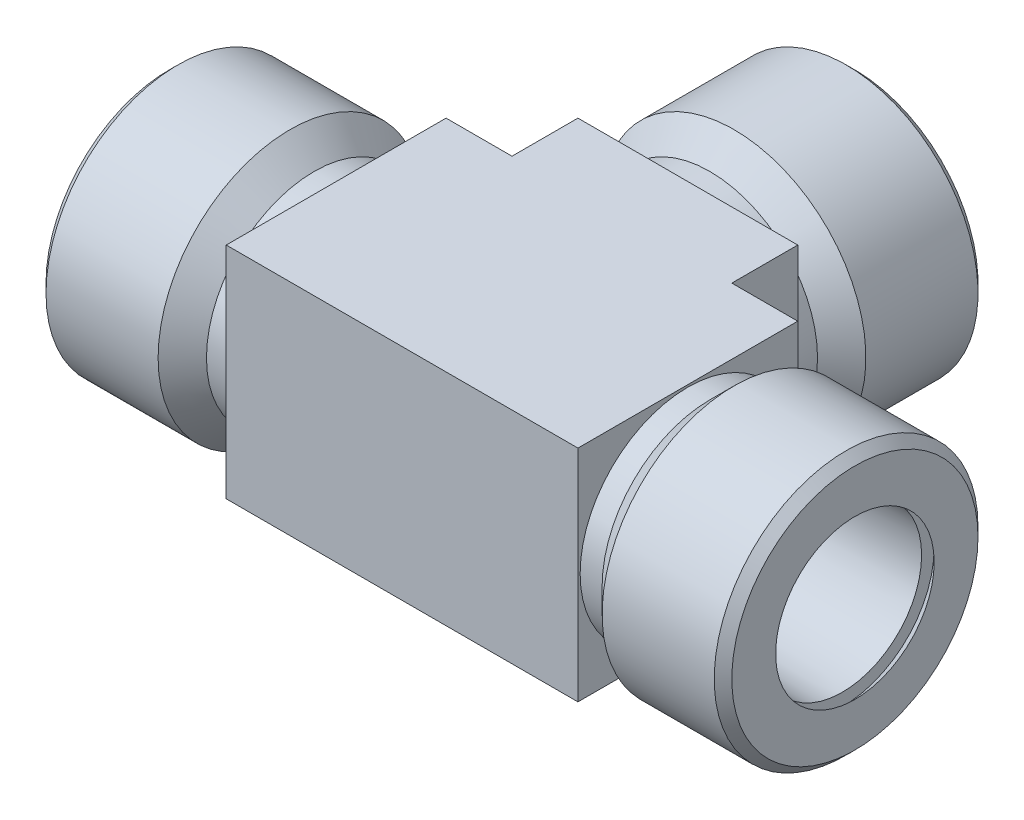
ISO-10303-21;
HEADER;
FILE_DESCRIPTION(('STEP AP214'),'2;1');
FILE_NAME('part.step','',(''),(''),'','','');
FILE_SCHEMA(('AUTOMOTIVE_DESIGN { 1 0 10303 214 1 1 1 1 }'));
ENDSEC;
DATA;
#1=APPLICATION_CONTEXT('core data for automotive mechanical design processes');
#2=APPLICATION_PROTOCOL_DEFINITION('international standard','automotive_design',2000,#1);
#3=PRODUCT_CONTEXT('',#1,'mechanical');
#4=PRODUCT('Part','Part','',(#3));
#5=PRODUCT_RELATED_PRODUCT_CATEGORY('part','',(#4));
#6=PRODUCT_DEFINITION_FORMATION('','',#4);
#7=PRODUCT_DEFINITION_CONTEXT('part definition',#1,'design');
#8=PRODUCT_DEFINITION('design','',#6,#7);
#9=PRODUCT_DEFINITION_SHAPE('','',#8);
#10=(LENGTH_UNIT() NAMED_UNIT(*) SI_UNIT(.MILLI.,.METRE.));
#11=(NAMED_UNIT(*) PLANE_ANGLE_UNIT() SI_UNIT($,.RADIAN.));
#12=(NAMED_UNIT(*) SI_UNIT($,.STERADIAN.) SOLID_ANGLE_UNIT());
#13=UNCERTAINTY_MEASURE_WITH_UNIT(LENGTH_MEASURE(1.E-05),#10,'distance_accuracy_value','');
#14=(GEOMETRIC_REPRESENTATION_CONTEXT(3) GLOBAL_UNCERTAINTY_ASSIGNED_CONTEXT((#13)) GLOBAL_UNIT_ASSIGNED_CONTEXT((#10,
#11,#12)) REPRESENTATION_CONTEXT('',''));
#15=CARTESIAN_POINT('',(0.,0.,0.));
#16=DIRECTION('',(0.,0.,1.));
#17=DIRECTION('',(1.,0.,0.));
#18=AXIS2_PLACEMENT_3D('',#15,#16,#17);
#19=CARTESIAN_POINT('',(65.67678,0.,0.));
#20=DIRECTION('',(-1.,0.,0.));
#21=DIRECTION('',(0.,0.,1.));
#22=AXIS2_PLACEMENT_3D('',#19,#20,#21);
#23=CYLINDRICAL_SURFACE('',#22,9.271);
#24=CARTESIAN_POINT('',(39.624,0.,0.));
#25=DIRECTION('',(0.707106781186548,0.,-0.707106781186547));
#26=DIRECTION('',(-0.707106781186547,0.,-0.707106781186548));
#27=AXIS2_PLACEMENT_3D('',#24,#25,#26);
#28=ELLIPSE('',#27,13.111173936761,9.271);
#29=CARTESIAN_POINT('',(39.624,9.271,0.));
#30=VERTEX_POINT('',#29);
#31=CARTESIAN_POINT('',(39.624,-9.271,0.));
#32=VERTEX_POINT('',#31);
#33=EDGE_CURVE('E85',#30,#32,#28,.F.);
#34=ORIENTED_EDGE('',*,*,#33,.F.);
#35=CARTESIAN_POINT('',(39.624,0.,0.));
#36=DIRECTION('',(-0.707106781186547,0.,-0.707106781186548));
#37=DIRECTION('',(0.707106781186548,0.,-0.707106781186547));
#38=AXIS2_PLACEMENT_3D('',#35,#36,#37);
#39=ELLIPSE('',#38,13.111173936761,9.271);
#40=EDGE_CURVE('E31',#32,#30,#39,.F.);
#41=ORIENTED_EDGE('',*,*,#40,.F.);
#42=EDGE_LOOP('',(#34,#41));
#43=FACE_BOUND('',#42,.T.);
#44=CARTESIAN_POINT('',(65.67678,0.,0.));
#45=DIRECTION('',(-1.,0.,0.));
#46=DIRECTION('',(0.,0.,-1.));
#47=AXIS2_PLACEMENT_3D('',#44,#45,#46);
#48=CIRCLE('',#47,9.271);
#49=CARTESIAN_POINT('',(65.67678,0.,-9.271));
#50=VERTEX_POINT('',#49);
#51=EDGE_CURVE('E94',#50,#50,#48,.T.);
#52=ORIENTED_EDGE('',*,*,#51,.F.);
#53=EDGE_LOOP('',(#52));
#54=FACE_BOUND('',#53,.T.);
#55=CARTESIAN_POINT('',(13.57122,0.,0.));
#56=DIRECTION('',(-1.,0.,0.));
#57=DIRECTION('',(0.,0.,-1.));
#58=AXIS2_PLACEMENT_3D('',#55,#56,#57);
#59=CIRCLE('',#58,9.271);
#60=CARTESIAN_POINT('',(13.57122,0.,-9.271));
#61=VERTEX_POINT('',#60);
#62=EDGE_CURVE('E91',#61,#61,#59,.T.);
#63=ORIENTED_EDGE('',*,*,#62,.T.);
#64=EDGE_LOOP('',(#63));
#65=FACE_BOUND('',#64,.T.);
#66=ADVANCED_FACE('F17',(#43,#54,#65),#23,.F.);
#67=CARTESIAN_POINT('',(65.67678,0.,0.));
#68=DIRECTION('',(1.,0.,0.));
#69=DIRECTION('',(0.,0.,-1.));
#70=AXIS2_PLACEMENT_3D('',#67,#68,#69);
#71=PLANE('',#70);
#72=CARTESIAN_POINT('',(65.67678,0.,0.));
#73=DIRECTION('',(-1.,0.,0.));
#74=DIRECTION('',(0.,0.,-1.));
#75=AXIS2_PLACEMENT_3D('',#72,#73,#74);
#76=CIRCLE('',#75,8.84936340276163);
#77=CARTESIAN_POINT('',(65.67678,0.,-8.84936340276163));
#78=VERTEX_POINT('',#77);
#79=EDGE_CURVE('E400',#78,#78,#76,.T.);
#80=ORIENTED_EDGE('',*,*,#79,.F.);
#81=EDGE_LOOP('',(#80));
#82=FACE_BOUND('',#81,.T.);
#83=ORIENTED_EDGE('',*,*,#51,.T.);
#84=EDGE_LOOP('',(#83));
#85=FACE_BOUND('',#84,.T.);
#86=ADVANCED_FACE('F217',(#82,#85),#71,.F.);
#87=CARTESIAN_POINT('',(13.57122,0.,0.));
#88=DIRECTION('',(1.,0.,0.));
#89=DIRECTION('',(0.,0.,-1.));
#90=AXIS2_PLACEMENT_3D('',#87,#88,#89);
#91=PLANE('',#90);
#92=CARTESIAN_POINT('',(13.57122,0.,0.));
#93=DIRECTION('',(1.,0.,0.));
#94=DIRECTION('',(0.,0.,1.));
#95=AXIS2_PLACEMENT_3D('',#92,#93,#94);
#96=CIRCLE('',#95,8.84936340276163);
#97=CARTESIAN_POINT('',(13.57122,0.,8.84936340276163));
#98=VERTEX_POINT('',#97);
#99=EDGE_CURVE('E340',#98,#98,#96,.T.);
#100=ORIENTED_EDGE('',*,*,#99,.F.);
#101=EDGE_LOOP('',(#100));
#102=FACE_BOUND('',#101,.T.);
#103=ORIENTED_EDGE('',*,*,#62,.F.);
#104=EDGE_LOOP('',(#103));
#105=FACE_BOUND('',#104,.T.);
#106=ADVANCED_FACE('F223',(#102,#105),#91,.T.);
#107=CARTESIAN_POINT('',(39.624,0.,-26.05278));
#108=DIRECTION('',(0.,0.,1.));
#109=DIRECTION('',(1.,0.,0.));
#110=AXIS2_PLACEMENT_3D('',#107,#108,#109);
#111=PLANE('',#110);
#112=CARTESIAN_POINT('',(39.624,0.,-26.05278));
#113=DIRECTION('',(0.,0.,1.));
#114=DIRECTION('',(-1.,0.,0.));
#115=AXIS2_PLACEMENT_3D('',#112,#113,#114);
#116=CIRCLE('',#115,8.84936340276166);
#117=CARTESIAN_POINT('',(30.7746365972383,0.,-26.05278));
#118=VERTEX_POINT('',#117);
#119=EDGE_CURVE('E333',#118,#118,#116,.T.);
#120=ORIENTED_EDGE('',*,*,#119,.F.);
#121=EDGE_LOOP('',(#120));
#122=FACE_BOUND('',#121,.T.);
#123=CARTESIAN_POINT('',(39.624,0.,-26.05278));
#124=DIRECTION('',(0.,0.,-1.));
#125=DIRECTION('',(1.,0.,0.));
#126=AXIS2_PLACEMENT_3D('',#123,#124,#125);
#127=CIRCLE('',#126,9.271);
#128=CARTESIAN_POINT('',(48.895,0.,-26.05278));
#129=VERTEX_POINT('',#128);
#130=EDGE_CURVE('E88',#129,#129,#127,.T.);
#131=ORIENTED_EDGE('',*,*,#130,.F.);
#132=EDGE_LOOP('',(#131));
#133=FACE_BOUND('',#132,.T.);
#134=ADVANCED_FACE('F352',(#122,#133),#111,.T.);
#135=CARTESIAN_POINT('',(39.624,0.,15.241));
#136=DIRECTION('',(0.,0.,-1.));
#137=DIRECTION('',(-1.,0.,0.));
#138=AXIS2_PLACEMENT_3D('',#135,#136,#137);
#139=CYLINDRICAL_SURFACE('',#138,9.271);
#140=ORIENTED_EDGE('',*,*,#130,.T.);
#141=EDGE_LOOP('',(#140));
#142=FACE_BOUND('',#141,.T.);
#143=ORIENTED_EDGE('',*,*,#40,.T.);
#144=ORIENTED_EDGE('',*,*,#33,.T.);
#145=EDGE_LOOP('',(#143,#144));
#146=FACE_BOUND('',#145,.T.);
#147=ADVANCED_FACE('F86',(#142,#146),#139,.F.);
#148=CARTESIAN_POINT('',(39.624,0.,-26.05278));
#149=DIRECTION('',(0.,0.,-1.));
#150=DIRECTION('',(-1.,0.,0.));
#151=AXIS2_PLACEMENT_3D('',#148,#149,#150);
#152=CONICAL_SURFACE('',#151,8.84936340276166,0.0256563400043201);
#153=CARTESIAN_POINT('',(39.624,0.,-38.172644));
#154=DIRECTION('',(0.,0.,-1.));
#155=DIRECTION('',(-1.,0.,0.));
#156=AXIS2_PLACEMENT_3D('',#153,#154,#155);
#157=CIRCLE('',#156,9.160383);
#158=CARTESIAN_POINT('',(30.463617,0.,-38.172644));
#159=VERTEX_POINT('',#158);
#160=EDGE_CURVE('E337',#159,#159,#157,.F.);
#161=ORIENTED_EDGE('',*,*,#160,.F.);
#162=EDGE_LOOP('',(#161));
#163=FACE_BOUND('',#162,.T.);
#164=ORIENTED_EDGE('',*,*,#119,.T.);
#165=EDGE_LOOP('',(#164));
#166=FACE_BOUND('',#165,.T.);
#167=ADVANCED_FACE('F307',(#163,#166),#152,.F.);
#168=CARTESIAN_POINT('',(59.944,-12.7,-20.32));
#169=DIRECTION('',(0.,0.,-1.));
#170=DIRECTION('',(-1.,0.,0.));
#171=AXIS2_PLACEMENT_3D('',#168,#169,#170);
#172=PLANE('',#171);
#173=DIRECTION('',(0.,-1.,0.));
#174=VECTOR('',#173,1.);
#175=CARTESIAN_POINT('',(26.924,12.7,-20.32));
#176=LINE('',#175,#174);
#177=CARTESIAN_POINT('',(26.924,12.7,-20.32));
#178=VERTEX_POINT('',#177);
#179=CARTESIAN_POINT('',(26.924,-12.7,-20.32));
#180=VERTEX_POINT('',#179);
#181=EDGE_CURVE('E133',#178,#180,#176,.T.);
#182=ORIENTED_EDGE('',*,*,#181,.F.);
#183=DIRECTION('',(-1.,0.,0.));
#184=VECTOR('',#183,1.);
#185=CARTESIAN_POINT('',(59.944,12.7,-20.32));
#186=LINE('',#185,#184);
#187=CARTESIAN_POINT('',(52.324,12.7,-20.32));
#188=VERTEX_POINT('',#187);
#189=EDGE_CURVE('E180',#188,#178,#186,.T.);
#190=ORIENTED_EDGE('',*,*,#189,.F.);
#191=DIRECTION('',(0.,-1.,0.));
#192=VECTOR('',#191,1.);
#193=CARTESIAN_POINT('',(52.324,12.7,-20.32));
#194=LINE('',#193,#192);
#195=CARTESIAN_POINT('',(52.324,-12.7,-20.32));
#196=VERTEX_POINT('',#195);
#197=EDGE_CURVE('E158',#188,#196,#194,.T.);
#198=ORIENTED_EDGE('',*,*,#197,.T.);
#199=DIRECTION('',(-1.,0.,0.));
#200=VECTOR('',#199,1.);
#201=CARTESIAN_POINT('',(59.944,-12.7,-20.32));
#202=LINE('',#201,#200);
#203=EDGE_CURVE('E169',#196,#180,#202,.T.);
#204=ORIENTED_EDGE('',*,*,#203,.T.);
#205=EDGE_LOOP('',(#182,#190,#198,#204));
#206=FACE_BOUND('',#205,.T.);
#207=CARTESIAN_POINT('',(39.624,0.,-20.32));
#208=DIRECTION('',(0.,0.,-1.));
#209=DIRECTION('',(-1.,0.,0.));
#210=AXIS2_PLACEMENT_3D('',#207,#208,#209);
#211=CIRCLE('',#210,12.446);
#212=CARTESIAN_POINT('',(27.178,0.,-20.32));
#213=VERTEX_POINT('',#212);
#214=EDGE_CURVE('E103',#213,#213,#211,.T.);
#215=ORIENTED_EDGE('',*,*,#214,.F.);
#216=EDGE_LOOP('',(#215));
#217=FACE_BOUND('',#216,.T.);
#218=ADVANCED_FACE('F304',(#206,#217),#172,.T.);
#219=CARTESIAN_POINT('',(59.944,-12.7,12.7));
#220=DIRECTION('',(1.,0.,0.));
#221=DIRECTION('',(0.,0.,-1.));
#222=AXIS2_PLACEMENT_3D('',#219,#220,#221);
#223=PLANE('',#222);
#224=DIRECTION('',(0.,-1.,0.));
#225=VECTOR('',#224,1.);
#226=CARTESIAN_POINT('',(59.944,12.7,-12.7));
#227=LINE('',#226,#225);
#228=CARTESIAN_POINT('',(59.944,12.7,-12.7));
#229=VERTEX_POINT('',#228);
#230=CARTESIAN_POINT('',(59.944,-12.7,-12.7));
#231=VERTEX_POINT('',#230);
#232=EDGE_CURVE('E155',#229,#231,#227,.T.);
#233=ORIENTED_EDGE('',*,*,#232,.F.);
#234=DIRECTION('',(0.,0.,-1.));
#235=VECTOR('',#234,1.);
#236=CARTESIAN_POINT('',(59.944,12.7,12.7));
#237=LINE('',#236,#235);
#238=CARTESIAN_POINT('',(59.944,12.7,12.7));
#239=VERTEX_POINT('',#238);
#240=EDGE_CURVE('E177',#239,#229,#237,.T.);
#241=ORIENTED_EDGE('',*,*,#240,.F.);
#242=DIRECTION('',(0.,1.,0.));
#243=VECTOR('',#242,1.);
#244=CARTESIAN_POINT('',(59.944,-12.7,12.7));
#245=LINE('',#244,#243);
#246=CARTESIAN_POINT('',(59.944,-12.7,12.7));
#247=VERTEX_POINT('',#246);
#248=EDGE_CURVE('E174',#247,#239,#245,.T.);
#249=ORIENTED_EDGE('',*,*,#248,.F.);
#250=DIRECTION('',(0.,0.,-1.));
#251=VECTOR('',#250,1.);
#252=CARTESIAN_POINT('',(59.944,-12.7,12.7));
#253=LINE('',#252,#251);
#254=EDGE_CURVE('E165',#247,#231,#253,.T.);
#255=ORIENTED_EDGE('',*,*,#254,.T.);
#256=EDGE_LOOP('',(#233,#241,#249,#255));
#257=FACE_BOUND('',#256,.T.);
#258=CARTESIAN_POINT('',(59.944,0.,0.));
#259=DIRECTION('',(1.,0.,0.));
#260=DIRECTION('',(0.,0.,-1.));
#261=AXIS2_PLACEMENT_3D('',#258,#259,#260);
#262=CIRCLE('',#261,12.446);
#263=CARTESIAN_POINT('',(59.944,0.,-12.446));
#264=VERTEX_POINT('',#263);
#265=EDGE_CURVE('E112',#264,#264,#262,.T.);
#266=ORIENTED_EDGE('',*,*,#265,.F.);
#267=EDGE_LOOP('',(#266));
#268=FACE_BOUND('',#267,.T.);
#269=ADVANCED_FACE('F302',(#257,#268),#223,.T.);
#270=CARTESIAN_POINT('',(19.304,-12.7,-20.32));
#271=DIRECTION('',(-1.,0.,0.));
#272=DIRECTION('',(0.,0.,1.));
#273=AXIS2_PLACEMENT_3D('',#270,#271,#272);
#274=PLANE('',#273);
#275=DIRECTION('',(0.,-1.,0.));
#276=VECTOR('',#275,1.);
#277=CARTESIAN_POINT('',(19.304,12.7,-12.7));
#278=LINE('',#277,#276);
#279=CARTESIAN_POINT('',(19.304,12.7,-12.7));
#280=VERTEX_POINT('',#279);
#281=CARTESIAN_POINT('',(19.304,-12.7,-12.7));
#282=VERTEX_POINT('',#281);
#283=EDGE_CURVE('E137',#280,#282,#278,.T.);
#284=ORIENTED_EDGE('',*,*,#283,.T.);
#285=DIRECTION('',(0.,0.,1.));
#286=VECTOR('',#285,1.);
#287=CARTESIAN_POINT('',(19.304,-12.7,-20.32));
#288=LINE('',#287,#286);
#289=CARTESIAN_POINT('',(19.304,-12.7,12.7));
#290=VERTEX_POINT('',#289);
#291=EDGE_CURVE('E172',#282,#290,#288,.T.);
#292=ORIENTED_EDGE('',*,*,#291,.T.);
#293=DIRECTION('',(0.,1.,0.));
#294=VECTOR('',#293,1.);
#295=CARTESIAN_POINT('',(19.304,-12.7,12.7));
#296=LINE('',#295,#294);
#297=CARTESIAN_POINT('',(19.304,12.7,12.7));
#298=VERTEX_POINT('',#297);
#299=EDGE_CURVE('E184',#290,#298,#296,.T.);
#300=ORIENTED_EDGE('',*,*,#299,.T.);
#301=DIRECTION('',(0.,0.,1.));
#302=VECTOR('',#301,1.);
#303=CARTESIAN_POINT('',(19.304,12.7,-20.32));
#304=LINE('',#303,#302);
#305=EDGE_CURVE('E166',#280,#298,#304,.T.);
#306=ORIENTED_EDGE('',*,*,#305,.F.);
#307=EDGE_LOOP('',(#284,#292,#300,#306));
#308=FACE_BOUND('',#307,.T.);
#309=CARTESIAN_POINT('',(19.304,0.,0.));
#310=DIRECTION('',(-1.,0.,0.));
#311=DIRECTION('',(0.,0.,1.));
#312=AXIS2_PLACEMENT_3D('',#309,#310,#311);
#313=CIRCLE('',#312,12.446);
#314=CARTESIAN_POINT('',(19.304,0.,12.446));
#315=VERTEX_POINT('',#314);
#316=EDGE_CURVE('E121',#315,#315,#313,.T.);
#317=ORIENTED_EDGE('',*,*,#316,.F.);
#318=EDGE_LOOP('',(#317));
#319=FACE_BOUND('',#318,.T.);
#320=ADVANCED_FACE('F299',(#308,#319),#274,.T.);
#321=CARTESIAN_POINT('',(19.304,-12.7,12.7));
#322=DIRECTION('',(0.,0.,1.));
#323=DIRECTION('',(1.,0.,0.));
#324=AXIS2_PLACEMENT_3D('',#321,#322,#323);
#325=PLANE('',#324);
#326=DIRECTION('',(1.,0.,0.));
#327=VECTOR('',#326,1.);
#328=CARTESIAN_POINT('',(19.304,12.7,12.7));
#329=LINE('',#328,#327);
#330=EDGE_CURVE('E157',#298,#239,#329,.T.);
#331=ORIENTED_EDGE('',*,*,#330,.F.);
#332=ORIENTED_EDGE('',*,*,#299,.F.);
#333=DIRECTION('',(1.,0.,0.));
#334=VECTOR('',#333,1.);
#335=CARTESIAN_POINT('',(19.304,-12.7,12.7));
#336=LINE('',#335,#334);
#337=EDGE_CURVE('E162',#290,#247,#336,.T.);
#338=ORIENTED_EDGE('',*,*,#337,.T.);
#339=ORIENTED_EDGE('',*,*,#248,.T.);
#340=EDGE_LOOP('',(#331,#332,#338,#339));
#341=FACE_BOUND('',#340,.T.);
#342=ADVANCED_FACE('F294',(#341),#325,.T.);
#343=CARTESIAN_POINT('',(59.944,-12.7,12.7));
#344=DIRECTION('',(0.,1.,0.));
#345=DIRECTION('',(0.,0.,1.));
#346=AXIS2_PLACEMENT_3D('',#343,#344,#345);
#347=PLANE('',#346);
#348=ORIENTED_EDGE('',*,*,#291,.F.);
#349=DIRECTION('',(-1.,0.,0.));
#350=VECTOR('',#349,1.);
#351=CARTESIAN_POINT('',(26.924,-12.7,-12.7));
#352=LINE('',#351,#350);
#353=CARTESIAN_POINT('',(26.924,-12.7,-12.7));
#354=VERTEX_POINT('',#353);
#355=EDGE_CURVE('E131',#354,#282,#352,.T.);
#356=ORIENTED_EDGE('',*,*,#355,.F.);
#357=DIRECTION('',(0.,0.,1.));
#358=VECTOR('',#357,1.);
#359=CARTESIAN_POINT('',(26.924,-12.7,-20.32));
#360=LINE('',#359,#358);
#361=EDGE_CURVE('E125',#180,#354,#360,.T.);
#362=ORIENTED_EDGE('',*,*,#361,.F.);
#363=ORIENTED_EDGE('',*,*,#203,.F.);
#364=DIRECTION('',(0.,0.,-1.));
#365=VECTOR('',#364,1.);
#366=CARTESIAN_POINT('',(52.324,-12.7,-12.7));
#367=LINE('',#366,#365);
#368=CARTESIAN_POINT('',(52.324,-12.7,-12.7));
#369=VERTEX_POINT('',#368);
#370=EDGE_CURVE('E148',#369,#196,#367,.T.);
#371=ORIENTED_EDGE('',*,*,#370,.F.);
#372=DIRECTION('',(-1.,0.,0.));
#373=VECTOR('',#372,1.);
#374=CARTESIAN_POINT('',(59.944,-12.7,-12.7));
#375=LINE('',#374,#373);
#376=EDGE_CURVE('E140',#231,#369,#375,.T.);
#377=ORIENTED_EDGE('',*,*,#376,.F.);
#378=ORIENTED_EDGE('',*,*,#254,.F.);
#379=ORIENTED_EDGE('',*,*,#337,.F.);
#380=EDGE_LOOP('',(#348,#356,#362,#363,#371,#377,#378,#379));
#381=FACE_BOUND('',#380,.T.);
#382=ADVANCED_FACE('F291',(#381),#347,.F.);
#383=CARTESIAN_POINT('',(59.944,12.7,12.7));
#384=DIRECTION('',(0.,1.,0.));
#385=DIRECTION('',(0.,0.,1.));
#386=AXIS2_PLACEMENT_3D('',#383,#384,#385);
#387=PLANE('',#386);
#388=DIRECTION('',(-1.,0.,0.));
#389=VECTOR('',#388,1.);
#390=CARTESIAN_POINT('',(26.924,12.7,-12.7));
#391=LINE('',#390,#389);
#392=CARTESIAN_POINT('',(26.924,12.7,-12.7));
#393=VERTEX_POINT('',#392);
#394=EDGE_CURVE('E39',#393,#280,#391,.T.);
#395=ORIENTED_EDGE('',*,*,#394,.T.);
#396=ORIENTED_EDGE('',*,*,#305,.T.);
#397=ORIENTED_EDGE('',*,*,#330,.T.);
#398=ORIENTED_EDGE('',*,*,#240,.T.);
#399=DIRECTION('',(-1.,0.,0.));
#400=VECTOR('',#399,1.);
#401=CARTESIAN_POINT('',(59.944,12.7,-12.7));
#402=LINE('',#401,#400);
#403=CARTESIAN_POINT('',(52.324,12.7,-12.7));
#404=VERTEX_POINT('',#403);
#405=EDGE_CURVE('E144',#229,#404,#402,.T.);
#406=ORIENTED_EDGE('',*,*,#405,.T.);
#407=DIRECTION('',(0.,0.,-1.));
#408=VECTOR('',#407,1.);
#409=CARTESIAN_POINT('',(52.324,12.7,-12.7));
#410=LINE('',#409,#408);
#411=EDGE_CURVE('E147',#404,#188,#410,.T.);
#412=ORIENTED_EDGE('',*,*,#411,.T.);
#413=ORIENTED_EDGE('',*,*,#189,.T.);
#414=DIRECTION('',(0.,0.,1.));
#415=VECTOR('',#414,1.);
#416=CARTESIAN_POINT('',(26.924,12.7,-20.32));
#417=LINE('',#416,#415);
#418=EDGE_CURVE('E128',#178,#393,#417,.T.);
#419=ORIENTED_EDGE('',*,*,#418,.T.);
#420=EDGE_LOOP('',(#395,#396,#397,#398,#406,#412,#413,#419));
#421=FACE_BOUND('',#420,.T.);
#422=ADVANCED_FACE('F289',(#421),#387,.T.);
#423=CARTESIAN_POINT('',(59.944,12.7,-12.7));
#424=DIRECTION('',(0.,0.,1.));
#425=DIRECTION('',(1.,0.,0.));
#426=AXIS2_PLACEMENT_3D('',#423,#424,#425);
#427=PLANE('',#426);
#428=ORIENTED_EDGE('',*,*,#376,.T.);
#429=DIRECTION('',(0.,-1.,0.));
#430=VECTOR('',#429,1.);
#431=CARTESIAN_POINT('',(52.324,12.7,-12.7));
#432=LINE('',#431,#430);
#433=EDGE_CURVE('E151',#404,#369,#432,.T.);
#434=ORIENTED_EDGE('',*,*,#433,.F.);
#435=ORIENTED_EDGE('',*,*,#405,.F.);
#436=ORIENTED_EDGE('',*,*,#232,.T.);
#437=EDGE_LOOP('',(#428,#434,#435,#436));
#438=FACE_BOUND('',#437,.T.);
#439=ADVANCED_FACE('F285',(#438),#427,.F.);
#440=CARTESIAN_POINT('',(52.324,12.7,-12.7));
#441=DIRECTION('',(-1.,0.,0.));
#442=DIRECTION('',(0.,0.,1.));
#443=AXIS2_PLACEMENT_3D('',#440,#441,#442);
#444=PLANE('',#443);
#445=ORIENTED_EDGE('',*,*,#370,.T.);
#446=ORIENTED_EDGE('',*,*,#197,.F.);
#447=ORIENTED_EDGE('',*,*,#411,.F.);
#448=ORIENTED_EDGE('',*,*,#433,.T.);
#449=EDGE_LOOP('',(#445,#446,#447,#448));
#450=FACE_BOUND('',#449,.T.);
#451=ADVANCED_FACE('F279',(#450),#444,.F.);
#452=CARTESIAN_POINT('',(26.924,12.7,-12.7));
#453=DIRECTION('',(0.,0.,1.));
#454=DIRECTION('',(1.,0.,0.));
#455=AXIS2_PLACEMENT_3D('',#452,#453,#454);
#456=PLANE('',#455);
#457=ORIENTED_EDGE('',*,*,#355,.T.);
#458=ORIENTED_EDGE('',*,*,#283,.F.);
#459=ORIENTED_EDGE('',*,*,#394,.F.);
#460=DIRECTION('',(0.,-1.,0.));
#461=VECTOR('',#460,1.);
#462=CARTESIAN_POINT('',(26.924,12.7,-12.7));
#463=LINE('',#462,#461);
#464=EDGE_CURVE('E141',#393,#354,#463,.T.);
#465=ORIENTED_EDGE('',*,*,#464,.T.);
#466=EDGE_LOOP('',(#457,#458,#459,#465));
#467=FACE_BOUND('',#466,.T.);
#468=ADVANCED_FACE('F276',(#467),#456,.F.);
#469=CARTESIAN_POINT('',(26.924,12.7,-20.32));
#470=DIRECTION('',(1.,0.,0.));
#471=DIRECTION('',(0.,0.,-1.));
#472=AXIS2_PLACEMENT_3D('',#469,#470,#471);
#473=PLANE('',#472);
#474=ORIENTED_EDGE('',*,*,#361,.T.);
#475=ORIENTED_EDGE('',*,*,#464,.F.);
#476=ORIENTED_EDGE('',*,*,#418,.F.);
#477=ORIENTED_EDGE('',*,*,#181,.T.);
#478=EDGE_LOOP('',(#474,#475,#476,#477));
#479=FACE_BOUND('',#478,.T.);
#480=ADVANCED_FACE('F274',(#479),#473,.F.);
#481=CARTESIAN_POINT('',(16.764,0.,0.));
#482=DIRECTION('',(1.,0.,0.));
#483=DIRECTION('',(0.,0.,-1.));
#484=AXIS2_PLACEMENT_3D('',#481,#482,#483);
#485=CYLINDRICAL_SURFACE('',#484,12.446);
#486=CARTESIAN_POINT('',(16.764,0.,0.));
#487=DIRECTION('',(-1.,0.,0.));
#488=DIRECTION('',(0.,0.,1.));
#489=AXIS2_PLACEMENT_3D('',#486,#487,#488);
#490=CIRCLE('',#489,12.446);
#491=CARTESIAN_POINT('',(16.764,0.,12.446));
#492=VERTEX_POINT('',#491);
#493=EDGE_CURVE('E122',#492,#492,#490,.T.);
#494=ORIENTED_EDGE('',*,*,#493,.F.);
#495=EDGE_LOOP('',(#494));
#496=FACE_BOUND('',#495,.T.);
#497=ORIENTED_EDGE('',*,*,#316,.T.);
#498=EDGE_LOOP('',(#497));
#499=FACE_BOUND('',#498,.T.);
#500=ADVANCED_FACE('F270',(#496,#499),#485,.T.);
#501=CARTESIAN_POINT('',(16.764,0.,0.));
#502=DIRECTION('',(-1.,0.,0.));
#503=DIRECTION('',(0.,0.,1.));
#504=AXIS2_PLACEMENT_3D('',#501,#502,#503);
#505=CONICAL_SURFACE('',#504,12.446,0.785398163397451);
#506=CARTESIAN_POINT('',(13.97,0.,0.));
#507=DIRECTION('',(-1.,0.,0.));
#508=DIRECTION('',(0.,0.,1.));
#509=AXIS2_PLACEMENT_3D('',#506,#507,#508);
#510=CIRCLE('',#509,15.24);
#511=CARTESIAN_POINT('',(13.97,0.,15.24));
#512=VERTEX_POINT('',#511);
#513=EDGE_CURVE('E116',#512,#512,#510,.T.);
#514=ORIENTED_EDGE('',*,*,#513,.F.);
#515=EDGE_LOOP('',(#514));
#516=FACE_BOUND('',#515,.T.);
#517=ORIENTED_EDGE('',*,*,#493,.T.);
#518=EDGE_LOOP('',(#517));
#519=FACE_BOUND('',#518,.T.);
#520=ADVANCED_FACE('F266',(#516,#519),#505,.T.);
#521=CARTESIAN_POINT('',(0.,0.,0.));
#522=DIRECTION('',(1.,0.,0.));
#523=DIRECTION('',(0.,0.,-1.));
#524=AXIS2_PLACEMENT_3D('',#521,#522,#523);
#525=CYLINDRICAL_SURFACE('',#524,15.24);
#526=CARTESIAN_POINT('',(1.016,0.,0.));
#527=DIRECTION('',(-1.,0.,0.));
#528=DIRECTION('',(0.,0.,1.));
#529=AXIS2_PLACEMENT_3D('',#526,#527,#528);
#530=CIRCLE('',#529,15.24);
#531=CARTESIAN_POINT('',(1.016,0.,15.24));
#532=VERTEX_POINT('',#531);
#533=EDGE_CURVE('E191',#532,#532,#530,.F.);
#534=ORIENTED_EDGE('',*,*,#533,.T.);
#535=EDGE_LOOP('',(#534));
#536=FACE_BOUND('',#535,.T.);
#537=ORIENTED_EDGE('',*,*,#513,.T.);
#538=EDGE_LOOP('',(#537));
#539=FACE_BOUND('',#538,.T.);
#540=ADVANCED_FACE('F262',(#536,#539),#525,.T.);
#541=CARTESIAN_POINT('',(0.,0.,0.));
#542=DIRECTION('',(-1.,0.,0.));
#543=DIRECTION('',(0.,0.,1.));
#544=AXIS2_PLACEMENT_3D('',#541,#542,#543);
#545=PLANE('',#544);
#546=CARTESIAN_POINT('',(0.,0.,0.));
#547=DIRECTION('',(-1.,0.,0.));
#548=DIRECTION('',(0.,0.,1.));
#549=AXIS2_PLACEMENT_3D('',#546,#547,#548);
#550=CIRCLE('',#549,14.224);
#551=CARTESIAN_POINT('',(0.,0.,14.224));
#552=VERTEX_POINT('',#551);
#553=EDGE_CURVE('E187',#552,#552,#550,.T.);
#554=ORIENTED_EDGE('',*,*,#553,.T.);
#555=EDGE_LOOP('',(#554));
#556=FACE_BOUND('',#555,.T.);
#557=CARTESIAN_POINT('',(0.,0.,0.));
#558=DIRECTION('',(-1.,0.,0.));
#559=DIRECTION('',(0.,0.,-1.));
#560=AXIS2_PLACEMENT_3D('',#557,#558,#559);
#561=CIRCLE('',#560,10.611739);
#562=CARTESIAN_POINT('',(0.,0.,-10.611739));
#563=VERTEX_POINT('',#562);
#564=EDGE_CURVE('E331',#563,#563,#561,.T.);
#565=ORIENTED_EDGE('',*,*,#564,.F.);
#566=EDGE_LOOP('',(#565));
#567=FACE_BOUND('',#566,.T.);
#568=ADVANCED_FACE('F258',(#556,#567),#545,.T.);
#569=CARTESIAN_POINT('',(62.484,0.,0.));
#570=DIRECTION('',(-1.,0.,0.));
#571=DIRECTION('',(0.,0.,1.));
#572=AXIS2_PLACEMENT_3D('',#569,#570,#571);
#573=CYLINDRICAL_SURFACE('',#572,12.446);
#574=CARTESIAN_POINT('',(62.484,0.,0.));
#575=DIRECTION('',(1.,0.,0.));
#576=DIRECTION('',(0.,0.,-1.));
#577=AXIS2_PLACEMENT_3D('',#574,#575,#576);
#578=CIRCLE('',#577,12.446);
#579=CARTESIAN_POINT('',(62.484,0.,-12.446));
#580=VERTEX_POINT('',#579);
#581=EDGE_CURVE('E113',#580,#580,#578,.T.);
#582=ORIENTED_EDGE('',*,*,#581,.F.);
#583=EDGE_LOOP('',(#582));
#584=FACE_BOUND('',#583,.T.);
#585=ORIENTED_EDGE('',*,*,#265,.T.);
#586=EDGE_LOOP('',(#585));
#587=FACE_BOUND('',#586,.T.);
#588=ADVANCED_FACE('F254',(#584,#587),#573,.T.);
#589=CARTESIAN_POINT('',(62.484,0.,0.));
#590=DIRECTION('',(1.,0.,0.));
#591=DIRECTION('',(0.,0.,-1.));
#592=AXIS2_PLACEMENT_3D('',#589,#590,#591);
#593=CONICAL_SURFACE('',#592,12.446,0.78539816339745);
#594=CARTESIAN_POINT('',(65.278,0.,0.));
#595=DIRECTION('',(1.,0.,0.));
#596=DIRECTION('',(0.,0.,-1.));
#597=AXIS2_PLACEMENT_3D('',#594,#595,#596);
#598=CIRCLE('',#597,15.24);
#599=CARTESIAN_POINT('',(65.278,0.,-15.24));
#600=VERTEX_POINT('',#599);
#601=EDGE_CURVE('E107',#600,#600,#598,.T.);
#602=ORIENTED_EDGE('',*,*,#601,.F.);
#603=EDGE_LOOP('',(#602));
#604=FACE_BOUND('',#603,.T.);
#605=ORIENTED_EDGE('',*,*,#581,.T.);
#606=EDGE_LOOP('',(#605));
#607=FACE_BOUND('',#606,.T.);
#608=ADVANCED_FACE('F250',(#604,#607),#593,.T.);
#609=CARTESIAN_POINT('',(79.248,0.,0.));
#610=DIRECTION('',(-1.,0.,0.));
#611=DIRECTION('',(0.,0.,1.));
#612=AXIS2_PLACEMENT_3D('',#609,#610,#611);
#613=CYLINDRICAL_SURFACE('',#612,15.24);
#614=CARTESIAN_POINT('',(78.232,0.,0.));
#615=DIRECTION('',(1.,0.,0.));
#616=DIRECTION('',(0.,0.,-1.));
#617=AXIS2_PLACEMENT_3D('',#614,#615,#616);
#618=CIRCLE('',#617,15.24);
#619=CARTESIAN_POINT('',(78.232,0.,-15.24));
#620=VERTEX_POINT('',#619);
#621=EDGE_CURVE('E197',#620,#620,#618,.F.);
#622=ORIENTED_EDGE('',*,*,#621,.T.);
#623=EDGE_LOOP('',(#622));
#624=FACE_BOUND('',#623,.T.);
#625=ORIENTED_EDGE('',*,*,#601,.T.);
#626=EDGE_LOOP('',(#625));
#627=FACE_BOUND('',#626,.T.);
#628=ADVANCED_FACE('F246',(#624,#627),#613,.T.);
#629=CARTESIAN_POINT('',(79.248,0.,0.));
#630=DIRECTION('',(1.,0.,0.));
#631=DIRECTION('',(0.,0.,-1.));
#632=AXIS2_PLACEMENT_3D('',#629,#630,#631);
#633=PLANE('',#632);
#634=CARTESIAN_POINT('',(79.248,0.,0.));
#635=DIRECTION('',(1.,0.,0.));
#636=DIRECTION('',(0.,0.,-1.));
#637=AXIS2_PLACEMENT_3D('',#634,#635,#636);
#638=CIRCLE('',#637,14.224);
#639=CARTESIAN_POINT('',(79.248,0.,-14.224));
#640=VERTEX_POINT('',#639);
#641=EDGE_CURVE('E194',#640,#640,#638,.T.);
#642=ORIENTED_EDGE('',*,*,#641,.T.);
#643=EDGE_LOOP('',(#642));
#644=FACE_BOUND('',#643,.T.);
#645=CARTESIAN_POINT('',(79.248,0.,0.));
#646=DIRECTION('',(1.,0.,0.));
#647=DIRECTION('',(0.,0.,-1.));
#648=AXIS2_PLACEMENT_3D('',#645,#646,#647);
#649=CIRCLE('',#648,9.160383);
#650=CARTESIAN_POINT('',(79.248,0.,-9.160383));
#651=VERTEX_POINT('',#650);
#652=EDGE_CURVE('E394',#651,#651,#649,.T.);
#653=ORIENTED_EDGE('',*,*,#652,.F.);
#654=EDGE_LOOP('',(#653));
#655=FACE_BOUND('',#654,.T.);
#656=ADVANCED_FACE('F242',(#644,#655),#633,.T.);
#657=CARTESIAN_POINT('',(39.624,0.,-22.86));
#658=DIRECTION('',(0.,0.,1.));
#659=DIRECTION('',(1.,0.,0.));
#660=AXIS2_PLACEMENT_3D('',#657,#658,#659);
#661=CYLINDRICAL_SURFACE('',#660,12.446);
#662=CARTESIAN_POINT('',(39.624,0.,-22.86));
#663=DIRECTION('',(0.,0.,-1.));
#664=DIRECTION('',(-1.,0.,0.));
#665=AXIS2_PLACEMENT_3D('',#662,#663,#664);
#666=CIRCLE('',#665,12.446);
#667=CARTESIAN_POINT('',(27.178,0.,-22.86));
#668=VERTEX_POINT('',#667);
#669=EDGE_CURVE('E104',#668,#668,#666,.T.);
#670=ORIENTED_EDGE('',*,*,#669,.F.);
#671=EDGE_LOOP('',(#670));
#672=FACE_BOUND('',#671,.T.);
#673=ORIENTED_EDGE('',*,*,#214,.T.);
#674=EDGE_LOOP('',(#673));
#675=FACE_BOUND('',#674,.T.);
#676=ADVANCED_FACE('F238',(#672,#675),#661,.T.);
#677=CARTESIAN_POINT('',(39.624,0.,-22.86));
#678=DIRECTION('',(0.,0.,-1.));
#679=DIRECTION('',(-1.,0.,0.));
#680=AXIS2_PLACEMENT_3D('',#677,#678,#679);
#681=CONICAL_SURFACE('',#680,12.446,0.785398163397452);
#682=CARTESIAN_POINT('',(39.624,0.,-25.654));
#683=DIRECTION('',(0.,0.,-1.));
#684=DIRECTION('',(-1.,0.,0.));
#685=AXIS2_PLACEMENT_3D('',#682,#683,#684);
#686=CIRCLE('',#685,15.24);
#687=CARTESIAN_POINT('',(24.384,0.,-25.654));
#688=VERTEX_POINT('',#687);
#689=EDGE_CURVE('E99',#688,#688,#686,.T.);
#690=ORIENTED_EDGE('',*,*,#689,.F.);
#691=EDGE_LOOP('',(#690));
#692=FACE_BOUND('',#691,.T.);
#693=ORIENTED_EDGE('',*,*,#669,.T.);
#694=EDGE_LOOP('',(#693));
#695=FACE_BOUND('',#694,.T.);
#696=ADVANCED_FACE('F234',(#692,#695),#681,.T.);
#697=CARTESIAN_POINT('',(39.624,0.,-39.624));
#698=DIRECTION('',(0.,0.,1.));
#699=DIRECTION('',(1.,0.,0.));
#700=AXIS2_PLACEMENT_3D('',#697,#698,#699);
#701=CYLINDRICAL_SURFACE('',#700,15.24);
#702=CARTESIAN_POINT('',(39.624,0.,-38.608));
#703=DIRECTION('',(0.,0.,-1.));
#704=DIRECTION('',(-1.,0.,0.));
#705=AXIS2_PLACEMENT_3D('',#702,#703,#704);
#706=CIRCLE('',#705,15.24);
#707=CARTESIAN_POINT('',(24.384,0.,-38.608));
#708=VERTEX_POINT('',#707);
#709=EDGE_CURVE('E11',#708,#708,#706,.F.);
#710=ORIENTED_EDGE('',*,*,#709,.T.);
#711=EDGE_LOOP('',(#710));
#712=FACE_BOUND('',#711,.T.);
#713=ORIENTED_EDGE('',*,*,#689,.T.);
#714=EDGE_LOOP('',(#713));
#715=FACE_BOUND('',#714,.T.);
#716=ADVANCED_FACE('F231',(#712,#715),#701,.T.);
#717=CARTESIAN_POINT('',(39.624,0.,-39.624));
#718=DIRECTION('',(0.,0.,-1.));
#719=DIRECTION('',(-1.,0.,0.));
#720=AXIS2_PLACEMENT_3D('',#717,#718,#719);
#721=PLANE('',#720);
#722=CARTESIAN_POINT('',(39.624,0.,-39.624));
#723=DIRECTION('',(0.,0.,-1.));
#724=DIRECTION('',(-1.,0.,0.));
#725=AXIS2_PLACEMENT_3D('',#722,#723,#724);
#726=CIRCLE('',#725,14.224);
#727=CARTESIAN_POINT('',(25.4,0.,-39.624));
#728=VERTEX_POINT('',#727);
#729=EDGE_CURVE('E25',#728,#728,#726,.T.);
#730=ORIENTED_EDGE('',*,*,#729,.T.);
#731=EDGE_LOOP('',(#730));
#732=FACE_BOUND('',#731,.T.);
#733=CARTESIAN_POINT('',(39.624,0.,-39.624));
#734=DIRECTION('',(0.,0.,-1.));
#735=DIRECTION('',(1.,0.,0.));
#736=AXIS2_PLACEMENT_3D('',#733,#734,#735);
#737=CIRCLE('',#736,10.611739);
#738=CARTESIAN_POINT('',(50.235739,0.,-39.624));
#739=VERTEX_POINT('',#738);
#740=EDGE_CURVE('E346',#739,#739,#737,.T.);
#741=ORIENTED_EDGE('',*,*,#740,.F.);
#742=EDGE_LOOP('',(#741));
#743=FACE_BOUND('',#742,.T.);
#744=ADVANCED_FACE('F202',(#732,#743),#721,.T.);
#745=CARTESIAN_POINT('',(39.624,0.,-39.624));
#746=DIRECTION('',(0.,0.,-1.));
#747=DIRECTION('',(1.,0.,0.));
#748=AXIS2_PLACEMENT_3D('',#745,#746,#747);
#749=CONICAL_SURFACE('',#748,10.611739,0.785398163397443);
#750=ORIENTED_EDGE('',*,*,#160,.T.);
#751=EDGE_LOOP('',(#750));
#752=FACE_BOUND('',#751,.T.);
#753=ORIENTED_EDGE('',*,*,#740,.T.);
#754=EDGE_LOOP('',(#753));
#755=FACE_BOUND('',#754,.T.);
#756=ADVANCED_FACE('F230',(#752,#755),#749,.F.);
#757=CARTESIAN_POINT('',(0.,0.,0.));
#758=DIRECTION('',(-1.,0.,0.));
#759=DIRECTION('',(0.,0.,-1.));
#760=AXIS2_PLACEMENT_3D('',#757,#758,#759);
#761=CONICAL_SURFACE('',#760,10.611739,0.785398163397445);
#762=CARTESIAN_POINT('',(1.45135600000002,0.,0.));
#763=DIRECTION('',(-1.,0.,0.));
#764=DIRECTION('',(0.,0.,1.));
#765=AXIS2_PLACEMENT_3D('',#762,#763,#764);
#766=CIRCLE('',#765,9.160383);
#767=CARTESIAN_POINT('',(1.45135600000002,0.,9.160383));
#768=VERTEX_POINT('',#767);
#769=EDGE_CURVE('E334',#768,#768,#766,.F.);
#770=ORIENTED_EDGE('',*,*,#769,.T.);
#771=EDGE_LOOP('',(#770));
#772=FACE_BOUND('',#771,.T.);
#773=ORIENTED_EDGE('',*,*,#564,.T.);
#774=EDGE_LOOP('',(#773));
#775=FACE_BOUND('',#774,.T.);
#776=ADVANCED_FACE('F367',(#772,#775),#761,.F.);
#777=CARTESIAN_POINT('',(13.57122,0.,0.));
#778=DIRECTION('',(-1.,0.,0.));
#779=DIRECTION('',(0.,0.,1.));
#780=AXIS2_PLACEMENT_3D('',#777,#778,#779);
#781=CONICAL_SURFACE('',#780,8.84936340276163,0.025656340004321);
#782=ORIENTED_EDGE('',*,*,#769,.F.);
#783=EDGE_LOOP('',(#782));
#784=FACE_BOUND('',#783,.T.);
#785=ORIENTED_EDGE('',*,*,#99,.T.);
#786=EDGE_LOOP('',(#785));
#787=FACE_BOUND('',#786,.T.);
#788=ADVANCED_FACE('F374',(#784,#787),#781,.F.);
#789=CARTESIAN_POINT('',(77.796644,0.,0.));
#790=DIRECTION('',(-1.,0.,0.));
#791=DIRECTION('',(0.,0.,1.));
#792=AXIS2_PLACEMENT_3D('',#789,#790,#791);
#793=PLANE('',#792);
#794=CARTESIAN_POINT('',(77.796644,0.,0.));
#795=DIRECTION('',(1.,0.,0.));
#796=DIRECTION('',(0.,0.,-1.));
#797=AXIS2_PLACEMENT_3D('',#794,#795,#796);
#798=CIRCLE('',#797,9.160383);
#799=CARTESIAN_POINT('',(77.796644,0.,-9.160383));
#800=VERTEX_POINT('',#799);
#801=EDGE_CURVE('E396',#800,#800,#798,.F.);
#802=ORIENTED_EDGE('',*,*,#801,.T.);
#803=EDGE_LOOP('',(#802));
#804=FACE_BOUND('',#803,.T.);
#805=CARTESIAN_POINT('',(77.796644,0.,0.));
#806=DIRECTION('',(1.,0.,0.));
#807=DIRECTION('',(0.,0.,-1.));
#808=AXIS2_PLACEMENT_3D('',#805,#806,#807);
#809=CIRCLE('',#808,10.611739);
#810=CARTESIAN_POINT('',(77.796644,0.,-10.611739));
#811=VERTEX_POINT('',#810);
#812=EDGE_CURVE('E391',#811,#811,#809,.T.);
#813=ORIENTED_EDGE('',*,*,#812,.T.);
#814=EDGE_LOOP('',(#813));
#815=FACE_BOUND('',#814,.T.);
#816=ADVANCED_FACE('F378',(#804,#815),#793,.F.);
#817=CARTESIAN_POINT('',(79.248,0.,0.));
#818=DIRECTION('',(-1.,0.,0.));
#819=DIRECTION('',(0.,0.,1.));
#820=AXIS2_PLACEMENT_3D('',#817,#818,#819);
#821=CONICAL_SURFACE('',#820,9.160383,0.785398163397435);
#822=ORIENTED_EDGE('',*,*,#812,.F.);
#823=EDGE_LOOP('',(#822));
#824=FACE_BOUND('',#823,.T.);
#825=ORIENTED_EDGE('',*,*,#652,.T.);
#826=EDGE_LOOP('',(#825));
#827=FACE_BOUND('',#826,.T.);
#828=ADVANCED_FACE('F322',(#824,#827),#821,.F.);
#829=CARTESIAN_POINT('',(65.67678,0.,0.));
#830=DIRECTION('',(1.,0.,0.));
#831=DIRECTION('',(0.,0.,-1.));
#832=AXIS2_PLACEMENT_3D('',#829,#830,#831);
#833=CONICAL_SURFACE('',#832,8.84936340276163,0.025656340004321);
#834=ORIENTED_EDGE('',*,*,#801,.F.);
#835=EDGE_LOOP('',(#834));
#836=FACE_BOUND('',#835,.T.);
#837=ORIENTED_EDGE('',*,*,#79,.T.);
#838=EDGE_LOOP('',(#837));
#839=FACE_BOUND('',#838,.T.);
#840=ADVANCED_FACE('F316',(#836,#839),#833,.F.);
#841=CARTESIAN_POINT('',(0.,0.,0.));
#842=DIRECTION('',(1.,0.,0.));
#843=DIRECTION('',(0.,0.,-1.));
#844=AXIS2_PLACEMENT_3D('',#841,#842,#843);
#845=CONICAL_SURFACE('',#844,14.224,0.785398163397452);
#846=ORIENTED_EDGE('',*,*,#533,.F.);
#847=EDGE_LOOP('',(#846));
#848=FACE_BOUND('',#847,.T.);
#849=ORIENTED_EDGE('',*,*,#553,.F.);
#850=EDGE_LOOP('',(#849));
#851=FACE_BOUND('',#850,.T.);
#852=ADVANCED_FACE('F213',(#848,#851),#845,.T.);
#853=CARTESIAN_POINT('',(79.248,0.,0.));
#854=DIRECTION('',(-1.,0.,0.));
#855=DIRECTION('',(0.,0.,1.));
#856=AXIS2_PLACEMENT_3D('',#853,#854,#855);
#857=CONICAL_SURFACE('',#856,14.224,0.785398163397448);
#858=ORIENTED_EDGE('',*,*,#621,.F.);
#859=EDGE_LOOP('',(#858));
#860=FACE_BOUND('',#859,.T.);
#861=ORIENTED_EDGE('',*,*,#641,.F.);
#862=EDGE_LOOP('',(#861));
#863=FACE_BOUND('',#862,.T.);
#864=ADVANCED_FACE('F206',(#860,#863),#857,.T.);
#865=CARTESIAN_POINT('',(39.624,0.,-39.624));
#866=DIRECTION('',(0.,0.,1.));
#867=DIRECTION('',(1.,0.,0.));
#868=AXIS2_PLACEMENT_3D('',#865,#866,#867);
#869=CONICAL_SURFACE('',#868,14.224,0.785398163397457);
#870=ORIENTED_EDGE('',*,*,#709,.F.);
#871=EDGE_LOOP('',(#870));
#872=FACE_BOUND('',#871,.T.);
#873=ORIENTED_EDGE('',*,*,#729,.F.);
#874=EDGE_LOOP('',(#873));
#875=FACE_BOUND('',#874,.T.);
#876=ADVANCED_FACE('F19',(#872,#875),#869,.T.);
#877=CLOSED_SHELL('',(#66,#86,#106,#134,#147,#167,#218,#269,#320,#342,#382,#422,#439,#451,#468,
#480,#500,#520,#540,#568,#588,#608,#628,#656,#676,#696,#716,#744,#756,#776,#788,#816,#828,#840,
#852,#864,#876));
#878=MANIFOLD_SOLID_BREP('B1',#877);
#879=ADVANCED_BREP_SHAPE_REPRESENTATION('',(#18,#878),#14);
#880=SHAPE_DEFINITION_REPRESENTATION(#9,#879);
ENDSEC;
END-ISO-10303-21;
